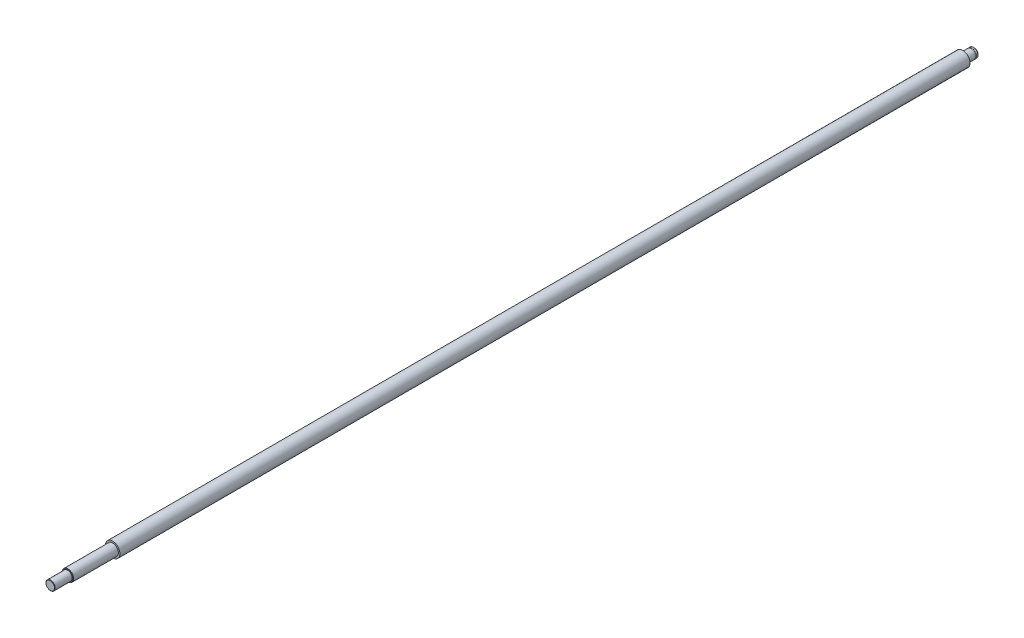
ISO-10303-21;
HEADER;
FILE_DESCRIPTION(('STEP AP214'),'2;1');
FILE_NAME('part.step','',(''),(''),'','','');
FILE_SCHEMA(('AUTOMOTIVE_DESIGN { 1 0 10303 214 1 1 1 1 }'));
ENDSEC;
DATA;
#1=APPLICATION_CONTEXT('core data for automotive mechanical design processes');
#2=APPLICATION_PROTOCOL_DEFINITION('international standard','automotive_design',2000,#1);
#3=PRODUCT_CONTEXT('',#1,'mechanical');
#4=PRODUCT('Part','Part','',(#3));
#5=PRODUCT_RELATED_PRODUCT_CATEGORY('part','',(#4));
#6=PRODUCT_DEFINITION_FORMATION('','',#4);
#7=PRODUCT_DEFINITION_CONTEXT('part definition',#1,'design');
#8=PRODUCT_DEFINITION('design','',#6,#7);
#9=PRODUCT_DEFINITION_SHAPE('','',#8);
#10=(LENGTH_UNIT() NAMED_UNIT(*) SI_UNIT(.MILLI.,.METRE.));
#11=(NAMED_UNIT(*) PLANE_ANGLE_UNIT() SI_UNIT($,.RADIAN.));
#12=(NAMED_UNIT(*) SI_UNIT($,.STERADIAN.) SOLID_ANGLE_UNIT());
#13=UNCERTAINTY_MEASURE_WITH_UNIT(LENGTH_MEASURE(1.E-05),#10,'distance_accuracy_value','');
#14=(GEOMETRIC_REPRESENTATION_CONTEXT(3) GLOBAL_UNCERTAINTY_ASSIGNED_CONTEXT((#13)) GLOBAL_UNIT_ASSIGNED_CONTEXT((#10,
#11,#12)) REPRESENTATION_CONTEXT('',''));
#15=CARTESIAN_POINT('',(0.,0.,0.));
#16=DIRECTION('',(0.,0.,1.));
#17=DIRECTION('',(1.,0.,0.));
#18=AXIS2_PLACEMENT_3D('',#15,#16,#17);
#19=CARTESIAN_POINT('',(0.,0.,400.));
#20=DIRECTION('',(0.,0.,-1.));
#21=DIRECTION('',(-1.,0.,0.));
#22=AXIS2_PLACEMENT_3D('',#19,#20,#21);
#23=PLANE('',#22);
#24=CARTESIAN_POINT('',(0.,0.,400.));
#25=DIRECTION('',(0.,0.,-1.));
#26=DIRECTION('',(-1.,0.,0.));
#27=AXIS2_PLACEMENT_3D('',#24,#25,#26);
#28=CIRCLE('',#27,3.70000000000004);
#29=CARTESIAN_POINT('',(-3.70000000000004,0.,400.));
#30=VERTEX_POINT('',#29);
#31=EDGE_CURVE('E50',#30,#30,#28,.F.);
#32=ORIENTED_EDGE('',*,*,#31,.T.);
#33=EDGE_LOOP('',(#32));
#34=FACE_BOUND('',#33,.T.);
#35=ADVANCED_FACE('F35',(#34),#23,.F.);
#36=CARTESIAN_POINT('',(0.,0.,400.));
#37=DIRECTION('',(0.,0.,1.));
#38=DIRECTION('',(1.,0.,0.));
#39=AXIS2_PLACEMENT_3D('',#36,#37,#38);
#40=CYLINDRICAL_SURFACE('',#39,4.);
#41=CARTESIAN_POINT('',(0.,0.,399.7));
#42=DIRECTION('',(0.,0.,-1.));
#43=DIRECTION('',(-1.,0.,0.));
#44=AXIS2_PLACEMENT_3D('',#41,#42,#43);
#45=CIRCLE('',#44,4.);
#46=CARTESIAN_POINT('',(-4.,0.,399.7));
#47=VERTEX_POINT('',#46);
#48=EDGE_CURVE('E46',#47,#47,#45,.T.);
#49=ORIENTED_EDGE('',*,*,#48,.T.);
#50=EDGE_LOOP('',(#49));
#51=FACE_BOUND('',#50,.T.);
#52=CARTESIAN_POINT('',(0.,0.,385.));
#53=DIRECTION('',(0.,0.,1.));
#54=DIRECTION('',(1.,0.,0.));
#55=AXIS2_PLACEMENT_3D('',#52,#53,#54);
#56=CIRCLE('',#55,4.);
#57=CARTESIAN_POINT('',(4.,0.,385.));
#58=VERTEX_POINT('',#57);
#59=EDGE_CURVE('E61',#58,#58,#56,.T.);
#60=ORIENTED_EDGE('',*,*,#59,.T.);
#61=EDGE_LOOP('',(#60));
#62=FACE_BOUND('',#61,.T.);
#63=ADVANCED_FACE('F129',(#51,#62),#40,.T.);
#64=CARTESIAN_POINT('',(0.,4.,385.));
#65=DIRECTION('',(0.,0.,-1.));
#66=DIRECTION('',(-1.,0.,0.));
#67=AXIS2_PLACEMENT_3D('',#64,#65,#66);
#68=PLANE('',#67);
#69=CARTESIAN_POINT('',(0.,0.,385.));
#70=DIRECTION('',(0.,0.,-1.));
#71=DIRECTION('',(-1.,0.,0.));
#72=AXIS2_PLACEMENT_3D('',#69,#70,#71);
#73=CIRCLE('',#72,4.64000000000009);
#74=CARTESIAN_POINT('',(-4.64000000000009,0.,385.));
#75=VERTEX_POINT('',#74);
#76=EDGE_CURVE('E42',#75,#75,#73,.F.);
#77=ORIENTED_EDGE('',*,*,#76,.T.);
#78=EDGE_LOOP('',(#77));
#79=FACE_BOUND('',#78,.T.);
#80=ORIENTED_EDGE('',*,*,#59,.F.);
#81=EDGE_LOOP('',(#80));
#82=FACE_BOUND('',#81,.T.);
#83=ADVANCED_FACE('F135',(#79,#82),#68,.F.);
#84=CARTESIAN_POINT('',(0.,0.,400.));
#85=DIRECTION('',(0.,0.,1.));
#86=DIRECTION('',(1.,0.,0.));
#87=AXIS2_PLACEMENT_3D('',#84,#85,#86);
#88=CYLINDRICAL_SURFACE('',#87,4.94);
#89=CARTESIAN_POINT('',(0.,0.,384.7));
#90=DIRECTION('',(0.,0.,-1.));
#91=DIRECTION('',(-1.,0.,0.));
#92=AXIS2_PLACEMENT_3D('',#89,#90,#91);
#93=CIRCLE('',#92,4.94);
#94=CARTESIAN_POINT('',(-4.94,0.,384.7));
#95=VERTEX_POINT('',#94);
#96=EDGE_CURVE('E10',#95,#95,#93,.T.);
#97=ORIENTED_EDGE('',*,*,#96,.T.);
#98=EDGE_LOOP('',(#97));
#99=FACE_BOUND('',#98,.T.);
#100=CARTESIAN_POINT('',(0.,0.,346.));
#101=DIRECTION('',(0.,0.,1.));
#102=DIRECTION('',(1.,0.,0.));
#103=AXIS2_PLACEMENT_3D('',#100,#101,#102);
#104=CIRCLE('',#103,4.94);
#105=CARTESIAN_POINT('',(4.94,0.,346.));
#106=VERTEX_POINT('',#105);
#107=EDGE_CURVE('E64',#106,#106,#104,.T.);
#108=ORIENTED_EDGE('',*,*,#107,.T.);
#109=EDGE_LOOP('',(#108));
#110=FACE_BOUND('',#109,.T.);
#111=ADVANCED_FACE('F157',(#99,#110),#88,.T.);
#112=CARTESIAN_POINT('',(0.,4.94,346.));
#113=DIRECTION('',(0.,0.,-1.));
#114=DIRECTION('',(-1.,0.,0.));
#115=AXIS2_PLACEMENT_3D('',#112,#113,#114);
#116=PLANE('',#115);
#117=ORIENTED_EDGE('',*,*,#107,.F.);
#118=EDGE_LOOP('',(#117));
#119=FACE_BOUND('',#118,.T.);
#120=CARTESIAN_POINT('',(0.,0.,346.));
#121=DIRECTION('',(0.,0.,1.));
#122=DIRECTION('',(1.,0.,0.));
#123=AXIS2_PLACEMENT_3D('',#120,#121,#122);
#124=CIRCLE('',#123,6.32);
#125=CARTESIAN_POINT('',(6.32,0.,346.));
#126=VERTEX_POINT('',#125);
#127=EDGE_CURVE('E67',#126,#126,#124,.T.);
#128=ORIENTED_EDGE('',*,*,#127,.T.);
#129=EDGE_LOOP('',(#128));
#130=FACE_BOUND('',#129,.T.);
#131=ADVANCED_FACE('F124',(#119,#130),#116,.F.);
#132=CARTESIAN_POINT('',(0.,0.,400.));
#133=DIRECTION('',(0.,0.,1.));
#134=DIRECTION('',(1.,0.,0.));
#135=AXIS2_PLACEMENT_3D('',#132,#133,#134);
#136=CYLINDRICAL_SURFACE('',#135,6.32);
#137=ORIENTED_EDGE('',*,*,#127,.F.);
#138=EDGE_LOOP('',(#137));
#139=FACE_BOUND('',#138,.T.);
#140=CARTESIAN_POINT('',(0.,0.,-390.));
#141=DIRECTION('',(0.,0.,1.));
#142=DIRECTION('',(1.,0.,0.));
#143=AXIS2_PLACEMENT_3D('',#140,#141,#142);
#144=CIRCLE('',#143,6.32);
#145=CARTESIAN_POINT('',(6.32,0.,-390.));
#146=VERTEX_POINT('',#145);
#147=EDGE_CURVE('E70',#146,#146,#144,.T.);
#148=ORIENTED_EDGE('',*,*,#147,.T.);
#149=EDGE_LOOP('',(#148));
#150=FACE_BOUND('',#149,.T.);
#151=ADVANCED_FACE('F118',(#139,#150),#136,.T.);
#152=CARTESIAN_POINT('',(0.,6.32,-390.));
#153=DIRECTION('',(0.,0.,1.));
#154=DIRECTION('',(1.,0.,0.));
#155=AXIS2_PLACEMENT_3D('',#152,#153,#154);
#156=PLANE('',#155);
#157=ORIENTED_EDGE('',*,*,#147,.F.);
#158=EDGE_LOOP('',(#157));
#159=FACE_BOUND('',#158,.T.);
#160=CARTESIAN_POINT('',(0.,0.,-390.));
#161=DIRECTION('',(0.,0.,1.));
#162=DIRECTION('',(1.,0.,0.));
#163=AXIS2_PLACEMENT_3D('',#160,#161,#162);
#164=CIRCLE('',#163,4.);
#165=CARTESIAN_POINT('',(4.,0.,-390.));
#166=VERTEX_POINT('',#165);
#167=EDGE_CURVE('E73',#166,#166,#164,.T.);
#168=ORIENTED_EDGE('',*,*,#167,.T.);
#169=EDGE_LOOP('',(#168));
#170=FACE_BOUND('',#169,.T.);
#171=ADVANCED_FACE('F113',(#159,#170),#156,.F.);
#172=CARTESIAN_POINT('',(0.,0.,400.));
#173=DIRECTION('',(0.,0.,1.));
#174=DIRECTION('',(1.,0.,0.));
#175=AXIS2_PLACEMENT_3D('',#172,#173,#174);
#176=CYLINDRICAL_SURFACE('',#175,4.);
#177=CARTESIAN_POINT('',(0.,0.,-397.));
#178=DIRECTION('',(0.,0.,-1.));
#179=DIRECTION('',(0.,1.,0.));
#180=AXIS2_PLACEMENT_3D('',#177,#178,#179);
#181=CIRCLE('',#180,4.00000000000001);
#182=CARTESIAN_POINT('',(0.,4.,-397.));
#183=VERTEX_POINT('',#182);
#184=EDGE_CURVE('E82',#183,#183,#181,.T.);
#185=ORIENTED_EDGE('',*,*,#184,.F.);
#186=EDGE_LOOP('',(#185));
#187=FACE_BOUND('',#186,.T.);
#188=ORIENTED_EDGE('',*,*,#167,.F.);
#189=EDGE_LOOP('',(#188));
#190=FACE_BOUND('',#189,.T.);
#191=ADVANCED_FACE('F95',(#187,#190),#176,.T.);
#192=CARTESIAN_POINT('',(0.,4.,-397.9));
#193=DIRECTION('',(0.,0.,-1.));
#194=DIRECTION('',(0.,1.,0.));
#195=AXIS2_PLACEMENT_3D('',#192,#193,#194);
#196=PLANE('',#195);
#197=CARTESIAN_POINT('',(0.,0.,-397.9));
#198=DIRECTION('',(0.,0.,-1.));
#199=DIRECTION('',(0.,1.,0.));
#200=AXIS2_PLACEMENT_3D('',#197,#198,#199);
#201=CIRCLE('',#200,4.00000000000001);
#202=CARTESIAN_POINT('',(0.,4.,-397.9));
#203=VERTEX_POINT('',#202);
#204=EDGE_CURVE('E85',#203,#203,#201,.T.);
#205=ORIENTED_EDGE('',*,*,#204,.F.);
#206=EDGE_LOOP('',(#205));
#207=FACE_BOUND('',#206,.T.);
#208=CARTESIAN_POINT('',(0.,0.,-397.9));
#209=DIRECTION('',(0.,0.,-1.));
#210=DIRECTION('',(0.,1.,0.));
#211=AXIS2_PLACEMENT_3D('',#208,#209,#210);
#212=CIRCLE('',#211,3.79999999999998);
#213=CARTESIAN_POINT('',(0.,3.79999999999998,-397.9));
#214=VERTEX_POINT('',#213);
#215=EDGE_CURVE('E76',#214,#214,#212,.T.);
#216=ORIENTED_EDGE('',*,*,#215,.T.);
#217=EDGE_LOOP('',(#216));
#218=FACE_BOUND('',#217,.T.);
#219=ADVANCED_FACE('F91',(#207,#218),#196,.F.);
#220=CARTESIAN_POINT('',(0.,0.,-400.));
#221=DIRECTION('',(0.,0.,-1.));
#222=DIRECTION('',(0.,1.,0.));
#223=AXIS2_PLACEMENT_3D('',#220,#221,#222);
#224=CYLINDRICAL_SURFACE('',#223,3.79999999999998);
#225=ORIENTED_EDGE('',*,*,#215,.F.);
#226=EDGE_LOOP('',(#225));
#227=FACE_BOUND('',#226,.T.);
#228=CARTESIAN_POINT('',(0.,0.,-397.));
#229=DIRECTION('',(0.,0.,-1.));
#230=DIRECTION('',(0.,1.,0.));
#231=AXIS2_PLACEMENT_3D('',#228,#229,#230);
#232=CIRCLE('',#231,3.79999999999998);
#233=CARTESIAN_POINT('',(0.,3.79999999999998,-397.));
#234=VERTEX_POINT('',#233);
#235=EDGE_CURVE('E79',#234,#234,#232,.T.);
#236=ORIENTED_EDGE('',*,*,#235,.T.);
#237=EDGE_LOOP('',(#236));
#238=FACE_BOUND('',#237,.T.);
#239=ADVANCED_FACE('F94',(#227,#238),#224,.T.);
#240=CARTESIAN_POINT('',(0.,4.,-397.));
#241=DIRECTION('',(0.,0.,1.));
#242=DIRECTION('',(0.,-1.,0.));
#243=AXIS2_PLACEMENT_3D('',#240,#241,#242);
#244=PLANE('',#243);
#245=ORIENTED_EDGE('',*,*,#235,.F.);
#246=EDGE_LOOP('',(#245));
#247=FACE_BOUND('',#246,.T.);
#248=ORIENTED_EDGE('',*,*,#184,.T.);
#249=EDGE_LOOP('',(#248));
#250=FACE_BOUND('',#249,.T.);
#251=ADVANCED_FACE('F101',(#247,#250),#244,.F.);
#252=CARTESIAN_POINT('',(0.,4.,-400.));
#253=DIRECTION('',(0.,0.,1.));
#254=DIRECTION('',(1.,0.,0.));
#255=AXIS2_PLACEMENT_3D('',#252,#253,#254);
#256=PLANE('',#255);
#257=CARTESIAN_POINT('',(0.,0.,-400.));
#258=DIRECTION('',(0.,0.,1.));
#259=DIRECTION('',(1.,0.,0.));
#260=AXIS2_PLACEMENT_3D('',#257,#258,#259);
#261=CIRCLE('',#260,3.2000000000002);
#262=CARTESIAN_POINT('',(3.2000000000002,0.,-400.));
#263=VERTEX_POINT('',#262);
#264=EDGE_CURVE('E55',#263,#263,#261,.F.);
#265=ORIENTED_EDGE('',*,*,#264,.T.);
#266=EDGE_LOOP('',(#265));
#267=FACE_BOUND('',#266,.T.);
#268=ADVANCED_FACE('F107',(#267),#256,.F.);
#269=CARTESIAN_POINT('',(0.,0.,-399.2));
#270=DIRECTION('',(0.,0.,1.));
#271=DIRECTION('',(1.,0.,0.));
#272=AXIS2_PLACEMENT_3D('',#269,#270,#271);
#273=CIRCLE('',#272,4.);
#274=CARTESIAN_POINT('',(4.,0.,-399.2));
#275=VERTEX_POINT('',#274);
#276=EDGE_CURVE('E58',#275,#275,#273,.T.);
#277=ORIENTED_EDGE('',*,*,#276,.T.);
#278=EDGE_LOOP('',(#277));
#279=FACE_BOUND('',#278,.T.);
#280=ORIENTED_EDGE('',*,*,#204,.T.);
#281=EDGE_LOOP('',(#280));
#282=FACE_BOUND('',#281,.T.);
#283=ADVANCED_FACE('F89',(#279,#282),#176,.T.);
#284=CARTESIAN_POINT('',(0.,0.,-399.2));
#285=DIRECTION('',(0.,0.,1.));
#286=DIRECTION('',(1.,0.,0.));
#287=AXIS2_PLACEMENT_3D('',#284,#285,#286);
#288=CONICAL_SURFACE('',#287,4.,0.785398163397377);
#289=ORIENTED_EDGE('',*,*,#264,.F.);
#290=EDGE_LOOP('',(#289));
#291=FACE_BOUND('',#290,.T.);
#292=ORIENTED_EDGE('',*,*,#276,.F.);
#293=EDGE_LOOP('',(#292));
#294=FACE_BOUND('',#293,.T.);
#295=ADVANCED_FACE('F140',(#291,#294),#288,.T.);
#296=CARTESIAN_POINT('',(0.,0.,400.));
#297=DIRECTION('',(0.,0.,-1.));
#298=DIRECTION('',(-1.,0.,0.));
#299=AXIS2_PLACEMENT_3D('',#296,#297,#298);
#300=CONICAL_SURFACE('',#299,3.70000000000004,0.785398163397443);
#301=ORIENTED_EDGE('',*,*,#48,.F.);
#302=EDGE_LOOP('',(#301));
#303=FACE_BOUND('',#302,.T.);
#304=ORIENTED_EDGE('',*,*,#31,.F.);
#305=EDGE_LOOP('',(#304));
#306=FACE_BOUND('',#305,.T.);
#307=ADVANCED_FACE('F142',(#303,#306),#300,.T.);
#308=CARTESIAN_POINT('',(0.,0.,385.));
#309=DIRECTION('',(0.,0.,-1.));
#310=DIRECTION('',(-1.,0.,0.));
#311=AXIS2_PLACEMENT_3D('',#308,#309,#310);
#312=CONICAL_SURFACE('',#311,4.64000000000009,0.78539816339745);
#313=ORIENTED_EDGE('',*,*,#96,.F.);
#314=EDGE_LOOP('',(#313));
#315=FACE_BOUND('',#314,.T.);
#316=ORIENTED_EDGE('',*,*,#76,.F.);
#317=EDGE_LOOP('',(#316));
#318=FACE_BOUND('',#317,.T.);
#319=ADVANCED_FACE('F37',(#315,#318),#312,.T.);
#320=CLOSED_SHELL('',(#35,#63,#83,#111,#131,#151,#171,#191,#219,#239,#251,#268,#283,#295,#307,#319));
#321=MANIFOLD_SOLID_BREP('B2',#320);
#322=ADVANCED_BREP_SHAPE_REPRESENTATION('',(#18,#321),#14);
#323=SHAPE_DEFINITION_REPRESENTATION(#9,#322);
ENDSEC;
END-ISO-10303-21;
